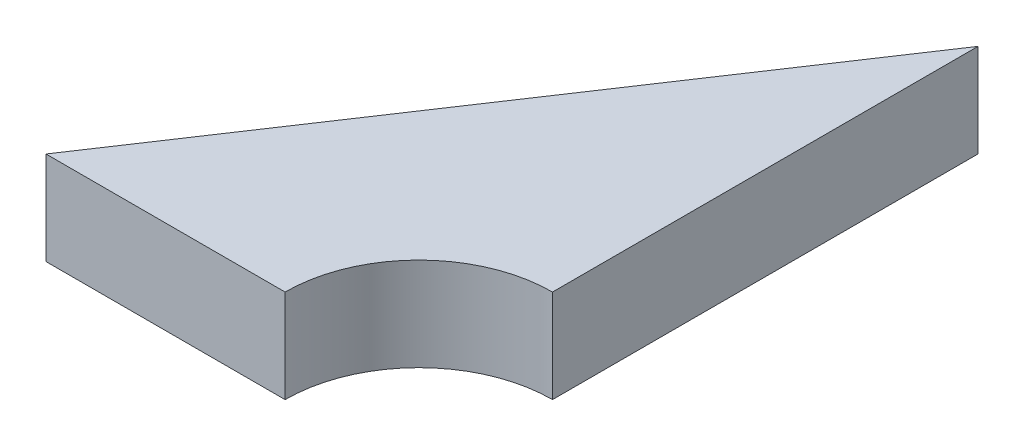
ISO-10303-21;
HEADER;
FILE_DESCRIPTION(('STEP AP214'),'2;1');
FILE_NAME('part.step','',(''),(''),'','','');
FILE_SCHEMA(('AUTOMOTIVE_DESIGN { 1 0 10303 214 1 1 1 1 }'));
ENDSEC;
DATA;
#1=APPLICATION_CONTEXT('core data for automotive mechanical design processes');
#2=APPLICATION_PROTOCOL_DEFINITION('international standard','automotive_design',2000,#1);
#3=PRODUCT_CONTEXT('',#1,'mechanical');
#4=PRODUCT('Part','Part','',(#3));
#5=PRODUCT_RELATED_PRODUCT_CATEGORY('part','',(#4));
#6=PRODUCT_DEFINITION_FORMATION('','',#4);
#7=PRODUCT_DEFINITION_CONTEXT('part definition',#1,'design');
#8=PRODUCT_DEFINITION('design','',#6,#7);
#9=PRODUCT_DEFINITION_SHAPE('','',#8);
#10=(LENGTH_UNIT() NAMED_UNIT(*) SI_UNIT(.MILLI.,.METRE.));
#11=(NAMED_UNIT(*) PLANE_ANGLE_UNIT() SI_UNIT($,.RADIAN.));
#12=(NAMED_UNIT(*) SI_UNIT($,.STERADIAN.) SOLID_ANGLE_UNIT());
#13=UNCERTAINTY_MEASURE_WITH_UNIT(LENGTH_MEASURE(1.E-05),#10,'distance_accuracy_value','');
#14=(GEOMETRIC_REPRESENTATION_CONTEXT(3) GLOBAL_UNCERTAINTY_ASSIGNED_CONTEXT((#13)) GLOBAL_UNIT_ASSIGNED_CONTEXT((#10,
#11,#12)) REPRESENTATION_CONTEXT('',''));
#15=CARTESIAN_POINT('',(0.,0.,0.));
#16=DIRECTION('',(0.,0.,1.));
#17=DIRECTION('',(1.,0.,0.));
#18=AXIS2_PLACEMENT_3D('',#15,#16,#17);
#19=CARTESIAN_POINT('',(9.80302287562258,5.,-25.84313701577));
#20=DIRECTION('',(0.832050294337844,0.,0.554700196225229));
#21=DIRECTION('',(0.554700196225229,0.,-0.832050294337844));
#22=AXIS2_PLACEMENT_3D('',#19,#20,#21);
#23=PLANE('',#22);
#24=DIRECTION('',(-0.554700196225229,0.,0.832050294337844));
#25=VECTOR('',#24,1.);
#26=CARTESIAN_POINT('',(9.80302287562258,0.,-25.84313701577));
#27=LINE('',#26,#25);
#28=CARTESIAN_POINT('',(9.80302287562258,0.,-25.84313701577));
#29=VERTEX_POINT('',#28);
#30=CARTESIAN_POINT('',(-10.1969771243774,0.,4.15686298423003));
#31=VERTEX_POINT('',#30);
#32=EDGE_CURVE('E95',#29,#31,#27,.T.);
#33=ORIENTED_EDGE('',*,*,#32,.T.);
#34=DIRECTION('',(0.,-1.,0.));
#35=VECTOR('',#34,1.);
#36=CARTESIAN_POINT('',(-10.1969771243774,5.,4.15686298423003));
#37=LINE('',#36,#35);
#38=CARTESIAN_POINT('',(-10.1969771243774,5.,4.15686298423003));
#39=VERTEX_POINT('',#38);
#40=EDGE_CURVE('E11',#39,#31,#37,.T.);
#41=ORIENTED_EDGE('',*,*,#40,.F.);
#42=DIRECTION('',(-0.554700196225229,0.,0.832050294337844));
#43=VECTOR('',#42,1.);
#44=CARTESIAN_POINT('',(9.80302287562258,5.,-25.84313701577));
#45=LINE('',#44,#43);
#46=CARTESIAN_POINT('',(9.80302287562258,5.,-25.84313701577));
#47=VERTEX_POINT('',#46);
#48=EDGE_CURVE('E83',#47,#39,#45,.T.);
#49=ORIENTED_EDGE('',*,*,#48,.F.);
#50=DIRECTION('',(0.,-1.,0.));
#51=VECTOR('',#50,1.);
#52=CARTESIAN_POINT('',(9.80302287562258,5.,-25.84313701577));
#53=LINE('',#52,#51);
#54=EDGE_CURVE('E91',#47,#29,#53,.T.);
#55=ORIENTED_EDGE('',*,*,#54,.T.);
#56=EDGE_LOOP('',(#33,#41,#49,#55));
#57=FACE_BOUND('',#56,.T.);
#58=ADVANCED_FACE('F32',(#57),#23,.F.);
#59=CARTESIAN_POINT('',(-10.1969771243774,5.,4.15686298423003));
#60=DIRECTION('',(0.,0.,-1.));
#61=DIRECTION('',(-1.,0.,0.));
#62=AXIS2_PLACEMENT_3D('',#59,#60,#61);
#63=PLANE('',#62);
#64=DIRECTION('',(1.,0.,0.));
#65=VECTOR('',#64,1.);
#66=CARTESIAN_POINT('',(-10.1969771243774,0.,4.15686298423003));
#67=LINE('',#66,#65);
#68=CARTESIAN_POINT('',(2.62927668403313,0.,4.15686298423003));
#69=VERTEX_POINT('',#68);
#70=EDGE_CURVE('E87',#31,#69,#67,.T.);
#71=ORIENTED_EDGE('',*,*,#70,.T.);
#72=DIRECTION('',(0.,-1.,0.));
#73=VECTOR('',#72,1.);
#74=CARTESIAN_POINT('',(2.62927668403313,5.,4.15686298423003));
#75=LINE('',#74,#73);
#76=CARTESIAN_POINT('',(2.62927668403313,5.,4.15686298423003));
#77=VERTEX_POINT('',#76);
#78=EDGE_CURVE('E40',#77,#69,#75,.T.);
#79=ORIENTED_EDGE('',*,*,#78,.F.);
#80=DIRECTION('',(1.,0.,0.));
#81=VECTOR('',#80,1.);
#82=CARTESIAN_POINT('',(-10.1969771243774,5.,4.15686298423003));
#83=LINE('',#82,#81);
#84=EDGE_CURVE('E78',#39,#77,#83,.T.);
#85=ORIENTED_EDGE('',*,*,#84,.F.);
#86=ORIENTED_EDGE('',*,*,#40,.T.);
#87=EDGE_LOOP('',(#71,#79,#85,#86));
#88=FACE_BOUND('',#87,.T.);
#89=ADVANCED_FACE('F86',(#88),#63,.F.);
#90=CARTESIAN_POINT('',(9.80302287562258,5.,4.15686298423003));
#91=DIRECTION('',(0.,-1.,0.));
#92=DIRECTION('',(0.,0.,-1.));
#93=AXIS2_PLACEMENT_3D('',#90,#91,#92);
#94=CYLINDRICAL_SURFACE('',#93,7.17374619158945);
#95=CARTESIAN_POINT('',(9.80302287562258,0.,4.15686298423003));
#96=DIRECTION('',(0.,-1.,0.));
#97=DIRECTION('',(0.,0.,1.));
#98=AXIS2_PLACEMENT_3D('',#95,#96,#97);
#99=CIRCLE('',#98,7.17374619158945);
#100=CARTESIAN_POINT('',(9.80302287562258,0.,-3.01688320735942));
#101=VERTEX_POINT('',#100);
#102=EDGE_CURVE('E65',#69,#101,#99,.T.);
#103=ORIENTED_EDGE('',*,*,#102,.T.);
#104=DIRECTION('',(0.,-1.,0.));
#105=VECTOR('',#104,1.);
#106=CARTESIAN_POINT('',(9.80302287562258,5.,-3.01688320735942));
#107=LINE('',#106,#105);
#108=CARTESIAN_POINT('',(9.80302287562258,5.,-3.01688320735942));
#109=VERTEX_POINT('',#108);
#110=EDGE_CURVE('E88',#109,#101,#107,.T.);
#111=ORIENTED_EDGE('',*,*,#110,.F.);
#112=CARTESIAN_POINT('',(9.80302287562258,5.,4.15686298423003));
#113=DIRECTION('',(0.,-1.,0.));
#114=DIRECTION('',(0.,0.,1.));
#115=AXIS2_PLACEMENT_3D('',#112,#113,#114);
#116=CIRCLE('',#115,7.17374619158945);
#117=EDGE_CURVE('E81',#77,#109,#116,.T.);
#118=ORIENTED_EDGE('',*,*,#117,.F.);
#119=ORIENTED_EDGE('',*,*,#78,.T.);
#120=EDGE_LOOP('',(#103,#111,#118,#119));
#121=FACE_BOUND('',#120,.T.);
#122=ADVANCED_FACE('F89',(#121),#94,.F.);
#123=CARTESIAN_POINT('',(9.80302287562258,5.,-3.01688320735942));
#124=DIRECTION('',(-1.,0.,0.));
#125=DIRECTION('',(0.,0.,1.));
#126=AXIS2_PLACEMENT_3D('',#123,#124,#125);
#127=PLANE('',#126);
#128=DIRECTION('',(0.,0.,-1.));
#129=VECTOR('',#128,1.);
#130=CARTESIAN_POINT('',(9.80302287562258,0.,-3.01688320735942));
#131=LINE('',#130,#129);
#132=EDGE_CURVE('E71',#101,#29,#131,.T.);
#133=ORIENTED_EDGE('',*,*,#132,.T.);
#134=ORIENTED_EDGE('',*,*,#54,.F.);
#135=DIRECTION('',(0.,0.,-1.));
#136=VECTOR('',#135,1.);
#137=CARTESIAN_POINT('',(9.80302287562258,5.,-3.01688320735942));
#138=LINE('',#137,#136);
#139=EDGE_CURVE('E48',#109,#47,#138,.T.);
#140=ORIENTED_EDGE('',*,*,#139,.F.);
#141=ORIENTED_EDGE('',*,*,#110,.T.);
#142=EDGE_LOOP('',(#133,#134,#140,#141));
#143=FACE_BOUND('',#142,.T.);
#144=ADVANCED_FACE('F102',(#143),#127,.F.);
#145=CARTESIAN_POINT('',(9.80302287562258,5.,4.15686298423003));
#146=DIRECTION('',(0.,1.,0.));
#147=DIRECTION('',(0.,0.,1.));
#148=AXIS2_PLACEMENT_3D('',#145,#146,#147);
#149=PLANE('',#148);
#150=ORIENTED_EDGE('',*,*,#48,.T.);
#151=ORIENTED_EDGE('',*,*,#84,.T.);
#152=ORIENTED_EDGE('',*,*,#117,.T.);
#153=ORIENTED_EDGE('',*,*,#139,.T.);
#154=EDGE_LOOP('',(#150,#151,#152,#153));
#155=FACE_BOUND('',#154,.T.);
#156=ADVANCED_FACE('F79',(#155),#149,.T.);
#157=CARTESIAN_POINT('',(9.80302287562258,0.,4.15686298423003));
#158=DIRECTION('',(0.,1.,0.));
#159=DIRECTION('',(0.,0.,1.));
#160=AXIS2_PLACEMENT_3D('',#157,#158,#159);
#161=PLANE('',#160);
#162=ORIENTED_EDGE('',*,*,#32,.F.);
#163=ORIENTED_EDGE('',*,*,#132,.F.);
#164=ORIENTED_EDGE('',*,*,#102,.F.);
#165=ORIENTED_EDGE('',*,*,#70,.F.);
#166=EDGE_LOOP('',(#162,#163,#164,#165));
#167=FACE_BOUND('',#166,.T.);
#168=ADVANCED_FACE('F105',(#167),#161,.F.);
#169=CLOSED_SHELL('',(#58,#89,#122,#144,#156,#168));
#170=MANIFOLD_SOLID_BREP('B2',#169);
#171=ADVANCED_BREP_SHAPE_REPRESENTATION('',(#18,#170),#14);
#172=SHAPE_DEFINITION_REPRESENTATION(#9,#171);
ENDSEC;
END-ISO-10303-21;
